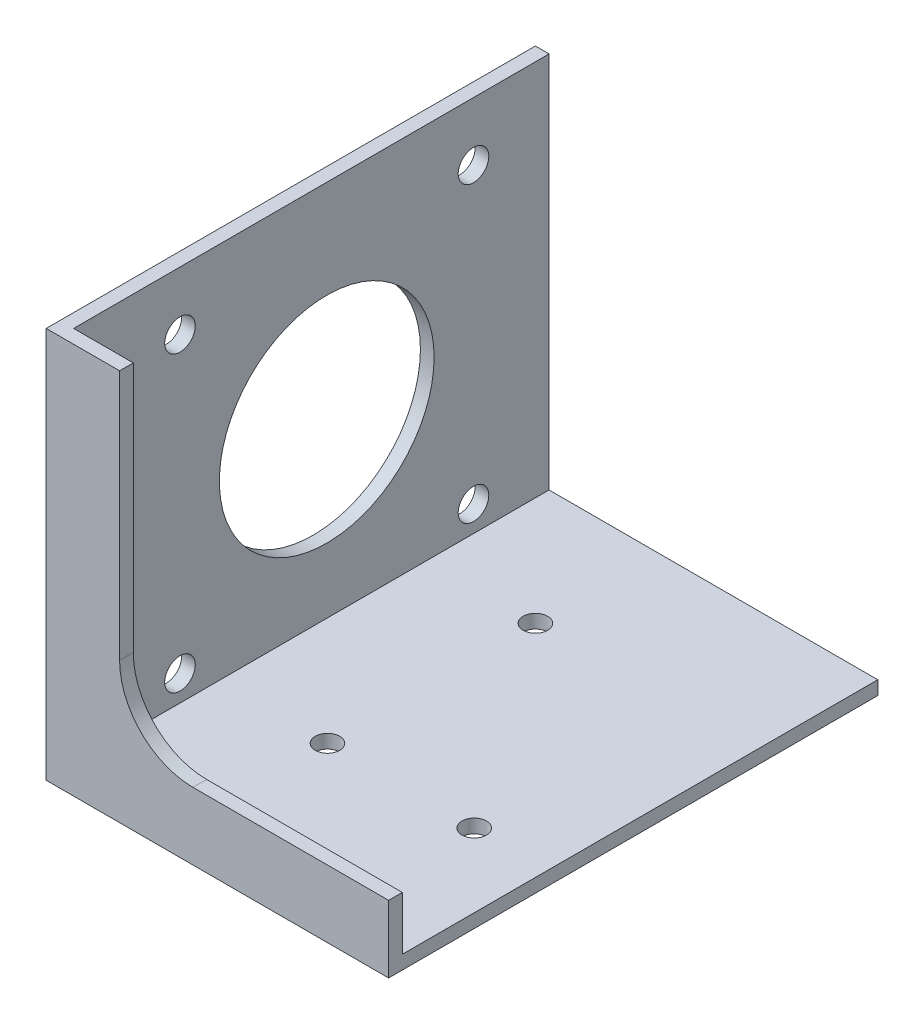
ISO-10303-21;
HEADER;
FILE_DESCRIPTION(('STEP AP214'),'2;1');
FILE_NAME('part.step','',(''),(''),'','','');
FILE_SCHEMA(('AUTOMOTIVE_DESIGN { 1 0 10303 214 1 1 1 1 }'));
ENDSEC;
DATA;
#1=APPLICATION_CONTEXT('core data for automotive mechanical design processes');
#2=APPLICATION_PROTOCOL_DEFINITION('international standard','automotive_design',2000,#1);
#3=PRODUCT_CONTEXT('',#1,'mechanical');
#4=PRODUCT('Part','Part','',(#3));
#5=PRODUCT_RELATED_PRODUCT_CATEGORY('part','',(#4));
#6=PRODUCT_DEFINITION_FORMATION('','',#4);
#7=PRODUCT_DEFINITION_CONTEXT('part definition',#1,'design');
#8=PRODUCT_DEFINITION('design','',#6,#7);
#9=PRODUCT_DEFINITION_SHAPE('','',#8);
#10=(LENGTH_UNIT() NAMED_UNIT(*) SI_UNIT(.MILLI.,.METRE.));
#11=(NAMED_UNIT(*) PLANE_ANGLE_UNIT() SI_UNIT($,.RADIAN.));
#12=(NAMED_UNIT(*) SI_UNIT($,.STERADIAN.) SOLID_ANGLE_UNIT());
#13=UNCERTAINTY_MEASURE_WITH_UNIT(LENGTH_MEASURE(1.E-05),#10,'distance_accuracy_value','');
#14=(GEOMETRIC_REPRESENTATION_CONTEXT(3) GLOBAL_UNCERTAINTY_ASSIGNED_CONTEXT((#13)) GLOBAL_UNIT_ASSIGNED_CONTEXT((#10,
#11,#12)) REPRESENTATION_CONTEXT('',''));
#15=CARTESIAN_POINT('',(0.,0.,0.));
#16=DIRECTION('',(0.,0.,1.));
#17=DIRECTION('',(1.,0.,0.));
#18=AXIS2_PLACEMENT_3D('',#15,#16,#17);
#19=CARTESIAN_POINT('',(-17.78,20.32,-25.4));
#20=DIRECTION('',(1.,0.,0.));
#21=DIRECTION('',(0.,0.,-1.));
#22=AXIS2_PLACEMENT_3D('',#19,#20,#21);
#23=PLANE('',#22);
#24=CARTESIAN_POINT('',(-17.78,-16.2306,12.9286));
#25=DIRECTION('',(1.,0.,0.));
#26=DIRECTION('',(0.,0.,-1.));
#27=AXIS2_PLACEMENT_3D('',#24,#25,#26);
#28=CIRCLE('',#27,1.5875);
#29=CARTESIAN_POINT('',(-17.78,-16.2306,11.3411));
#30=VERTEX_POINT('',#29);
#31=EDGE_CURVE('E205',#30,#30,#28,.T.);
#32=ORIENTED_EDGE('',*,*,#31,.T.);
#33=EDGE_LOOP('',(#32));
#34=FACE_BOUND('',#33,.T.);
#35=CARTESIAN_POINT('',(-17.78,-16.2306,-17.5514));
#36=DIRECTION('',(1.,0.,0.));
#37=DIRECTION('',(0.,0.,-1.));
#38=AXIS2_PLACEMENT_3D('',#35,#36,#37);
#39=CIRCLE('',#38,1.5875);
#40=CARTESIAN_POINT('',(-17.78,-16.2306,-19.1389));
#41=VERTEX_POINT('',#40);
#42=EDGE_CURVE('E209',#41,#41,#39,.T.);
#43=ORIENTED_EDGE('',*,*,#42,.T.);
#44=EDGE_LOOP('',(#43));
#45=FACE_BOUND('',#44,.T.);
#46=CARTESIAN_POINT('',(-17.78,14.2494,-17.5514));
#47=DIRECTION('',(1.,0.,0.));
#48=DIRECTION('',(0.,0.,-1.));
#49=AXIS2_PLACEMENT_3D('',#46,#47,#48);
#50=CIRCLE('',#49,1.5875);
#51=CARTESIAN_POINT('',(-17.78,14.2494,-19.1389));
#52=VERTEX_POINT('',#51);
#53=EDGE_CURVE('E213',#52,#52,#50,.T.);
#54=ORIENTED_EDGE('',*,*,#53,.T.);
#55=EDGE_LOOP('',(#54));
#56=FACE_BOUND('',#55,.T.);
#57=CARTESIAN_POINT('',(-17.78,14.2494,12.9286));
#58=DIRECTION('',(1.,0.,0.));
#59=DIRECTION('',(0.,0.,-1.));
#60=AXIS2_PLACEMENT_3D('',#57,#58,#59);
#61=CIRCLE('',#60,1.5875);
#62=CARTESIAN_POINT('',(-17.78,14.2494,11.3411));
#63=VERTEX_POINT('',#62);
#64=EDGE_CURVE('E217',#63,#63,#61,.T.);
#65=ORIENTED_EDGE('',*,*,#64,.T.);
#66=EDGE_LOOP('',(#65));
#67=FACE_BOUND('',#66,.T.);
#68=CARTESIAN_POINT('',(-17.78,-0.990599999999998,-2.3114));
#69=DIRECTION('',(1.,0.,0.));
#70=DIRECTION('',(0.,0.,-1.));
#71=AXIS2_PLACEMENT_3D('',#68,#69,#70);
#72=CIRCLE('',#71,11.1506);
#73=CARTESIAN_POINT('',(-17.78,-0.990599999999998,-13.462));
#74=VERTEX_POINT('',#73);
#75=EDGE_CURVE('E220',#74,#74,#72,.T.);
#76=ORIENTED_EDGE('',*,*,#75,.T.);
#77=EDGE_LOOP('',(#76));
#78=FACE_BOUND('',#77,.T.);
#79=DIRECTION('',(0.,0.,1.));
#80=VECTOR('',#79,1.);
#81=CARTESIAN_POINT('',(-17.78,-20.32,-25.4));
#82=LINE('',#81,#80);
#83=CARTESIAN_POINT('',(-17.78,-20.32,-25.4));
#84=VERTEX_POINT('',#83);
#85=CARTESIAN_POINT('',(-17.78,-20.32,25.4));
#86=VERTEX_POINT('',#85);
#87=EDGE_CURVE('E160',#84,#86,#82,.T.);
#88=ORIENTED_EDGE('',*,*,#87,.T.);
#89=DIRECTION('',(0.,-1.,0.));
#90=VECTOR('',#89,1.);
#91=CARTESIAN_POINT('',(-17.78,20.32,25.4));
#92=LINE('',#91,#90);
#93=CARTESIAN_POINT('',(-17.78,20.32,25.4));
#94=VERTEX_POINT('',#93);
#95=EDGE_CURVE('E12',#94,#86,#92,.T.);
#96=ORIENTED_EDGE('',*,*,#95,.F.);
#97=DIRECTION('',(0.,0.,1.));
#98=VECTOR('',#97,1.);
#99=CARTESIAN_POINT('',(-17.78,20.32,-25.4));
#100=LINE('',#99,#98);
#101=CARTESIAN_POINT('',(-17.78,20.32,-25.4));
#102=VERTEX_POINT('',#101);
#103=EDGE_CURVE('E147',#102,#94,#100,.T.);
#104=ORIENTED_EDGE('',*,*,#103,.F.);
#105=DIRECTION('',(0.,-1.,0.));
#106=VECTOR('',#105,1.);
#107=CARTESIAN_POINT('',(-17.78,20.32,-25.4));
#108=LINE('',#107,#106);
#109=EDGE_CURVE('E154',#102,#84,#108,.T.);
#110=ORIENTED_EDGE('',*,*,#109,.T.);
#111=EDGE_LOOP('',(#88,#96,#104,#110));
#112=FACE_BOUND('',#111,.T.);
#113=ADVANCED_FACE('F43',(#34,#45,#56,#67,#78,#112),#23,.F.);
#114=CARTESIAN_POINT('',(-17.78,20.32,25.4));
#115=DIRECTION('',(0.,0.,-1.));
#116=DIRECTION('',(-1.,0.,0.));
#117=AXIS2_PLACEMENT_3D('',#114,#115,#116);
#118=PLANE('',#117);
#119=CARTESIAN_POINT('',(-2.54,-5.715,25.4));
#120=DIRECTION('',(0.,0.,1.));
#121=DIRECTION('',(1.,0.,0.));
#122=AXIS2_PLACEMENT_3D('',#119,#120,#121);
#123=CIRCLE('',#122,7.62);
#124=CARTESIAN_POINT('',(-10.16,-5.715,25.4));
#125=VERTEX_POINT('',#124);
#126=CARTESIAN_POINT('',(-2.54,-13.335,25.4));
#127=VERTEX_POINT('',#126);
#128=EDGE_CURVE('E134',#125,#127,#123,.T.);
#129=ORIENTED_EDGE('',*,*,#128,.F.);
#130=DIRECTION('',(0.,1.,0.));
#131=VECTOR('',#130,1.);
#132=CARTESIAN_POINT('',(-10.16,-5.715,25.4));
#133=LINE('',#132,#131);
#134=CARTESIAN_POINT('',(-10.16,20.32,25.4));
#135=VERTEX_POINT('',#134);
#136=EDGE_CURVE('E125',#125,#135,#133,.T.);
#137=ORIENTED_EDGE('',*,*,#136,.T.);
#138=DIRECTION('',(1.,0.,0.));
#139=VECTOR('',#138,1.);
#140=CARTESIAN_POINT('',(-17.78,20.32,25.4));
#141=LINE('',#140,#139);
#142=EDGE_CURVE('E138',#94,#135,#141,.T.);
#143=ORIENTED_EDGE('',*,*,#142,.F.);
#144=ORIENTED_EDGE('',*,*,#95,.T.);
#145=DIRECTION('',(1.,0.,0.));
#146=VECTOR('',#145,1.);
#147=CARTESIAN_POINT('',(-17.78,-20.32,25.4));
#148=LINE('',#147,#146);
#149=CARTESIAN_POINT('',(17.78,-20.32,25.4));
#150=VERTEX_POINT('',#149);
#151=EDGE_CURVE('E164',#86,#150,#148,.T.);
#152=ORIENTED_EDGE('',*,*,#151,.T.);
#153=DIRECTION('',(0.,-1.,0.));
#154=VECTOR('',#153,1.);
#155=CARTESIAN_POINT('',(17.78,20.32,25.4));
#156=LINE('',#155,#154);
#157=CARTESIAN_POINT('',(17.78,-13.335,25.4));
#158=VERTEX_POINT('',#157);
#159=EDGE_CURVE('E51',#158,#150,#156,.T.);
#160=ORIENTED_EDGE('',*,*,#159,.F.);
#161=DIRECTION('',(-1.,0.,0.));
#162=VECTOR('',#161,1.);
#163=CARTESIAN_POINT('',(17.78,-13.335,25.4));
#164=LINE('',#163,#162);
#165=EDGE_CURVE('E142',#158,#127,#164,.T.);
#166=ORIENTED_EDGE('',*,*,#165,.T.);
#167=EDGE_LOOP('',(#129,#137,#143,#144,#152,#160,#166));
#168=FACE_BOUND('',#167,.T.);
#169=ADVANCED_FACE('F137',(#168),#118,.F.);
#170=CARTESIAN_POINT('',(17.78,20.32,-25.4));
#171=DIRECTION('',(-1.,0.,0.));
#172=DIRECTION('',(0.,0.,1.));
#173=AXIS2_PLACEMENT_3D('',#170,#171,#172);
#174=PLANE('',#173);
#175=DIRECTION('',(0.,-1.,0.));
#176=VECTOR('',#175,1.);
#177=CARTESIAN_POINT('',(17.78,20.32,23.9776));
#178=LINE('',#177,#176);
#179=CARTESIAN_POINT('',(17.78,-13.335,23.9776));
#180=VERTEX_POINT('',#179);
#181=CARTESIAN_POINT('',(17.78,-18.8976,23.9776));
#182=VERTEX_POINT('',#181);
#183=EDGE_CURVE('E273',#180,#182,#178,.T.);
#184=ORIENTED_EDGE('',*,*,#183,.F.);
#185=DIRECTION('',(0.,0.,-1.));
#186=VECTOR('',#185,1.);
#187=CARTESIAN_POINT('',(17.78,-13.335,25.4));
#188=LINE('',#187,#186);
#189=EDGE_CURVE('E58',#158,#180,#188,.T.);
#190=ORIENTED_EDGE('',*,*,#189,.F.);
#191=ORIENTED_EDGE('',*,*,#159,.T.);
#192=DIRECTION('',(0.,0.,-1.));
#193=VECTOR('',#192,1.);
#194=CARTESIAN_POINT('',(17.78,-20.32,-25.4));
#195=LINE('',#194,#193);
#196=CARTESIAN_POINT('',(17.78,-20.32,-25.4));
#197=VERTEX_POINT('',#196);
#198=EDGE_CURVE('E169',#150,#197,#195,.T.);
#199=ORIENTED_EDGE('',*,*,#198,.T.);
#200=DIRECTION('',(0.,-1.,0.));
#201=VECTOR('',#200,1.);
#202=CARTESIAN_POINT('',(17.78,20.32,-25.4));
#203=LINE('',#202,#201);
#204=CARTESIAN_POINT('',(17.78,-18.8976,-25.4));
#205=VERTEX_POINT('',#204);
#206=EDGE_CURVE('E178',#205,#197,#203,.T.);
#207=ORIENTED_EDGE('',*,*,#206,.F.);
#208=DIRECTION('',(0.,0.,-1.));
#209=VECTOR('',#208,1.);
#210=CARTESIAN_POINT('',(17.78,-18.8976,23.9776));
#211=LINE('',#210,#209);
#212=EDGE_CURVE('E288',#182,#205,#211,.T.);
#213=ORIENTED_EDGE('',*,*,#212,.F.);
#214=EDGE_LOOP('',(#184,#190,#191,#199,#207,#213));
#215=FACE_BOUND('',#214,.T.);
#216=ADVANCED_FACE('F184',(#215),#174,.F.);
#217=CARTESIAN_POINT('',(-17.78,20.32,-25.4));
#218=DIRECTION('',(0.,0.,1.));
#219=DIRECTION('',(1.,0.,0.));
#220=AXIS2_PLACEMENT_3D('',#217,#218,#219);
#221=PLANE('',#220);
#222=DIRECTION('',(0.,-1.,0.));
#223=VECTOR('',#222,1.);
#224=CARTESIAN_POINT('',(-16.3576,20.32,-25.4));
#225=LINE('',#224,#223);
#226=CARTESIAN_POINT('',(-16.3576,20.32,-25.4));
#227=VERTEX_POINT('',#226);
#228=CARTESIAN_POINT('',(-16.3576,-18.8976,-25.4));
#229=VERTEX_POINT('',#228);
#230=EDGE_CURVE('E66',#227,#229,#225,.T.);
#231=ORIENTED_EDGE('',*,*,#230,.T.);
#232=DIRECTION('',(1.,0.,0.));
#233=VECTOR('',#232,1.);
#234=CARTESIAN_POINT('',(-80.8368595120309,-18.8976,-25.4));
#235=LINE('',#234,#233);
#236=EDGE_CURVE('E281',#229,#205,#235,.T.);
#237=ORIENTED_EDGE('',*,*,#236,.T.);
#238=ORIENTED_EDGE('',*,*,#206,.T.);
#239=DIRECTION('',(-1.,0.,0.));
#240=VECTOR('',#239,1.);
#241=CARTESIAN_POINT('',(-17.78,-20.32,-25.4));
#242=LINE('',#241,#240);
#243=EDGE_CURVE('E156',#197,#84,#242,.T.);
#244=ORIENTED_EDGE('',*,*,#243,.T.);
#245=ORIENTED_EDGE('',*,*,#109,.F.);
#246=DIRECTION('',(-1.,0.,0.));
#247=VECTOR('',#246,1.);
#248=CARTESIAN_POINT('',(-17.78,20.32,-25.4));
#249=LINE('',#248,#247);
#250=EDGE_CURVE('E150',#227,#102,#249,.T.);
#251=ORIENTED_EDGE('',*,*,#250,.F.);
#252=EDGE_LOOP('',(#231,#237,#238,#244,#245,#251));
#253=FACE_BOUND('',#252,.T.);
#254=ADVANCED_FACE('F193',(#253),#221,.F.);
#255=CARTESIAN_POINT('',(0.,20.32,0.));
#256=DIRECTION('',(0.,1.,0.));
#257=DIRECTION('',(0.,0.,1.));
#258=AXIS2_PLACEMENT_3D('',#255,#256,#257);
#259=PLANE('',#258);
#260=DIRECTION('',(0.,0.,-1.));
#261=VECTOR('',#260,1.);
#262=CARTESIAN_POINT('',(-10.16,20.32,25.4));
#263=LINE('',#262,#261);
#264=CARTESIAN_POINT('',(-10.16,20.32,23.9776));
#265=VERTEX_POINT('',#264);
#266=EDGE_CURVE('E122',#135,#265,#263,.T.);
#267=ORIENTED_EDGE('',*,*,#266,.T.);
#268=DIRECTION('',(1.,0.,0.));
#269=VECTOR('',#268,1.);
#270=CARTESIAN_POINT('',(-80.8368595120309,20.32,23.9776));
#271=LINE('',#270,#269);
#272=CARTESIAN_POINT('',(-16.3576,20.32,23.9776));
#273=VERTEX_POINT('',#272);
#274=EDGE_CURVE('E291',#273,#265,#271,.T.);
#275=ORIENTED_EDGE('',*,*,#274,.F.);
#276=DIRECTION('',(0.,0.,-1.));
#277=VECTOR('',#276,1.);
#278=CARTESIAN_POINT('',(-16.3576,20.32,23.9776));
#279=LINE('',#278,#277);
#280=EDGE_CURVE('E165',#273,#227,#279,.T.);
#281=ORIENTED_EDGE('',*,*,#280,.T.);
#282=ORIENTED_EDGE('',*,*,#250,.T.);
#283=ORIENTED_EDGE('',*,*,#103,.T.);
#284=ORIENTED_EDGE('',*,*,#142,.T.);
#285=EDGE_LOOP('',(#267,#275,#281,#282,#283,#284));
#286=FACE_BOUND('',#285,.T.);
#287=ADVANCED_FACE('F145',(#286),#259,.T.);
#288=CARTESIAN_POINT('',(0.,-20.32,0.));
#289=DIRECTION('',(0.,1.,0.));
#290=DIRECTION('',(0.,0.,1.));
#291=AXIS2_PLACEMENT_3D('',#288,#289,#290);
#292=PLANE('',#291);
#293=CARTESIAN_POINT('',(-5.08,-20.32,-12.7));
#294=DIRECTION('',(0.,1.,0.));
#295=DIRECTION('',(0.,0.,1.));
#296=AXIS2_PLACEMENT_3D('',#293,#294,#295);
#297=CIRCLE('',#296,1.27);
#298=CARTESIAN_POINT('',(-5.08,-20.32,-11.43));
#299=VERTEX_POINT('',#298);
#300=EDGE_CURVE('E262',#299,#299,#297,.T.);
#301=ORIENTED_EDGE('',*,*,#300,.T.);
#302=EDGE_LOOP('',(#301));
#303=FACE_BOUND('',#302,.T.);
#304=CARTESIAN_POINT('',(10.16,-20.32,8.89));
#305=DIRECTION('',(0.,1.,0.));
#306=DIRECTION('',(0.,0.,1.));
#307=AXIS2_PLACEMENT_3D('',#304,#305,#306);
#308=CIRCLE('',#307,1.27);
#309=CARTESIAN_POINT('',(10.16,-20.32,10.16));
#310=VERTEX_POINT('',#309);
#311=EDGE_CURVE('E253',#310,#310,#308,.T.);
#312=ORIENTED_EDGE('',*,*,#311,.T.);
#313=EDGE_LOOP('',(#312));
#314=FACE_BOUND('',#313,.T.);
#315=CARTESIAN_POINT('',(-5.08,-20.32,8.89));
#316=DIRECTION('',(0.,1.,0.));
#317=DIRECTION('',(0.,0.,1.));
#318=AXIS2_PLACEMENT_3D('',#315,#316,#317);
#319=CIRCLE('',#318,1.27);
#320=CARTESIAN_POINT('',(-5.08,-20.32,10.16));
#321=VERTEX_POINT('',#320);
#322=EDGE_CURVE('E269',#321,#321,#319,.T.);
#323=ORIENTED_EDGE('',*,*,#322,.T.);
#324=EDGE_LOOP('',(#323));
#325=FACE_BOUND('',#324,.T.);
#326=ORIENTED_EDGE('',*,*,#87,.F.);
#327=ORIENTED_EDGE('',*,*,#243,.F.);
#328=ORIENTED_EDGE('',*,*,#198,.F.);
#329=ORIENTED_EDGE('',*,*,#151,.F.);
#330=EDGE_LOOP('',(#326,#327,#328,#329));
#331=FACE_BOUND('',#330,.T.);
#332=ADVANCED_FACE('F190',(#303,#314,#325,#331),#292,.F.);
#333=CARTESIAN_POINT('',(-80.8368595120309,-18.8976,23.9776));
#334=DIRECTION('',(0.,-1.,0.));
#335=DIRECTION('',(0.,0.,-1.));
#336=AXIS2_PLACEMENT_3D('',#333,#334,#335);
#337=PLANE('',#336);
#338=CARTESIAN_POINT('',(-5.08,-18.8976,-12.7));
#339=DIRECTION('',(0.,1.,0.));
#340=DIRECTION('',(0.,0.,1.));
#341=AXIS2_PLACEMENT_3D('',#338,#339,#340);
#342=CIRCLE('',#341,1.27);
#343=CARTESIAN_POINT('',(-5.08,-18.8976,-11.43));
#344=VERTEX_POINT('',#343);
#345=EDGE_CURVE('E247',#344,#344,#342,.T.);
#346=ORIENTED_EDGE('',*,*,#345,.F.);
#347=EDGE_LOOP('',(#346));
#348=FACE_BOUND('',#347,.T.);
#349=CARTESIAN_POINT('',(10.16,-18.8976,8.89));
#350=DIRECTION('',(0.,1.,0.));
#351=DIRECTION('',(0.,0.,1.));
#352=AXIS2_PLACEMENT_3D('',#349,#350,#351);
#353=CIRCLE('',#352,1.27);
#354=CARTESIAN_POINT('',(10.16,-18.8976,10.16));
#355=VERTEX_POINT('',#354);
#356=EDGE_CURVE('E258',#355,#355,#353,.T.);
#357=ORIENTED_EDGE('',*,*,#356,.F.);
#358=EDGE_LOOP('',(#357));
#359=FACE_BOUND('',#358,.T.);
#360=CARTESIAN_POINT('',(-5.08,-18.8976,8.89));
#361=DIRECTION('',(0.,1.,0.));
#362=DIRECTION('',(0.,0.,1.));
#363=AXIS2_PLACEMENT_3D('',#360,#361,#362);
#364=CIRCLE('',#363,1.27);
#365=CARTESIAN_POINT('',(-5.08,-18.8976,10.16));
#366=VERTEX_POINT('',#365);
#367=EDGE_CURVE('E257',#366,#366,#364,.T.);
#368=ORIENTED_EDGE('',*,*,#367,.F.);
#369=EDGE_LOOP('',(#368));
#370=FACE_BOUND('',#369,.T.);
#371=DIRECTION('',(0.,0.,1.));
#372=VECTOR('',#371,1.);
#373=CARTESIAN_POINT('',(-16.3576,-18.8976,23.9776));
#374=LINE('',#373,#372);
#375=CARTESIAN_POINT('',(-16.3576,-18.8976,23.9776));
#376=VERTEX_POINT('',#375);
#377=EDGE_CURVE('E280',#229,#376,#374,.T.);
#378=ORIENTED_EDGE('',*,*,#377,.T.);
#379=DIRECTION('',(1.,0.,0.));
#380=VECTOR('',#379,1.);
#381=CARTESIAN_POINT('',(-80.8368595120309,-18.8976,23.9776));
#382=LINE('',#381,#380);
#383=EDGE_CURVE('E294',#376,#182,#382,.T.);
#384=ORIENTED_EDGE('',*,*,#383,.T.);
#385=ORIENTED_EDGE('',*,*,#212,.T.);
#386=ORIENTED_EDGE('',*,*,#236,.F.);
#387=EDGE_LOOP('',(#378,#384,#385,#386));
#388=FACE_BOUND('',#387,.T.);
#389=ADVANCED_FACE('F304',(#348,#359,#370,#388),#337,.F.);
#390=CARTESIAN_POINT('',(-80.8368595120309,20.32,23.9776));
#391=DIRECTION('',(0.,0.,1.));
#392=DIRECTION('',(1.,0.,0.));
#393=AXIS2_PLACEMENT_3D('',#390,#391,#392);
#394=PLANE('',#393);
#395=ORIENTED_EDGE('',*,*,#274,.T.);
#396=DIRECTION('',(0.,1.,0.));
#397=VECTOR('',#396,1.);
#398=CARTESIAN_POINT('',(-10.16,-5.715,23.9776));
#399=LINE('',#398,#397);
#400=CARTESIAN_POINT('',(-10.16,-5.715,23.9776));
#401=VERTEX_POINT('',#400);
#402=EDGE_CURVE('E128',#401,#265,#399,.T.);
#403=ORIENTED_EDGE('',*,*,#402,.F.);
#404=CARTESIAN_POINT('',(-2.54,-5.715,23.9776));
#405=DIRECTION('',(0.,0.,1.));
#406=DIRECTION('',(1.,0.,0.));
#407=AXIS2_PLACEMENT_3D('',#404,#405,#406);
#408=CIRCLE('',#407,7.62);
#409=CARTESIAN_POINT('',(-2.54,-13.335,23.9776));
#410=VERTEX_POINT('',#409);
#411=EDGE_CURVE('E143',#401,#410,#408,.T.);
#412=ORIENTED_EDGE('',*,*,#411,.T.);
#413=DIRECTION('',(-1.,0.,0.));
#414=VECTOR('',#413,1.);
#415=CARTESIAN_POINT('',(17.78,-13.335,23.9776));
#416=LINE('',#415,#414);
#417=EDGE_CURVE('E227',#180,#410,#416,.T.);
#418=ORIENTED_EDGE('',*,*,#417,.F.);
#419=ORIENTED_EDGE('',*,*,#183,.T.);
#420=ORIENTED_EDGE('',*,*,#383,.F.);
#421=DIRECTION('',(0.,1.,0.));
#422=VECTOR('',#421,1.);
#423=CARTESIAN_POINT('',(-16.3576,20.32,23.9776));
#424=LINE('',#423,#422);
#425=EDGE_CURVE('E277',#376,#273,#424,.T.);
#426=ORIENTED_EDGE('',*,*,#425,.T.);
#427=EDGE_LOOP('',(#395,#403,#412,#418,#419,#420,#426));
#428=FACE_BOUND('',#427,.T.);
#429=ADVANCED_FACE('F307',(#428),#394,.F.);
#430=CARTESIAN_POINT('',(-16.3576,20.32,-25.4));
#431=DIRECTION('',(1.,0.,0.));
#432=DIRECTION('',(0.,0.,-1.));
#433=AXIS2_PLACEMENT_3D('',#430,#431,#432);
#434=PLANE('',#433);
#435=CARTESIAN_POINT('',(-16.3576,-16.2306,12.9286));
#436=DIRECTION('',(1.,0.,0.));
#437=DIRECTION('',(0.,0.,-1.));
#438=AXIS2_PLACEMENT_3D('',#435,#436,#437);
#439=CIRCLE('',#438,1.5875);
#440=CARTESIAN_POINT('',(-16.3576,-16.2306,11.3411));
#441=VERTEX_POINT('',#440);
#442=EDGE_CURVE('E232',#441,#441,#439,.T.);
#443=ORIENTED_EDGE('',*,*,#442,.F.);
#444=EDGE_LOOP('',(#443));
#445=FACE_BOUND('',#444,.T.);
#446=CARTESIAN_POINT('',(-16.3576,-16.2306,-17.5514));
#447=DIRECTION('',(1.,0.,0.));
#448=DIRECTION('',(0.,0.,-1.));
#449=AXIS2_PLACEMENT_3D('',#446,#447,#448);
#450=CIRCLE('',#449,1.5875);
#451=CARTESIAN_POINT('',(-16.3576,-16.2306,-19.1389));
#452=VERTEX_POINT('',#451);
#453=EDGE_CURVE('E491',#452,#452,#450,.T.);
#454=ORIENTED_EDGE('',*,*,#453,.F.);
#455=EDGE_LOOP('',(#454));
#456=FACE_BOUND('',#455,.T.);
#457=CARTESIAN_POINT('',(-16.3576,14.2494,-17.5514));
#458=DIRECTION('',(1.,0.,0.));
#459=DIRECTION('',(0.,0.,-1.));
#460=AXIS2_PLACEMENT_3D('',#457,#458,#459);
#461=CIRCLE('',#460,1.5875);
#462=CARTESIAN_POINT('',(-16.3576,14.2494,-19.1389));
#463=VERTEX_POINT('',#462);
#464=EDGE_CURVE('E498',#463,#463,#461,.T.);
#465=ORIENTED_EDGE('',*,*,#464,.F.);
#466=EDGE_LOOP('',(#465));
#467=FACE_BOUND('',#466,.T.);
#468=CARTESIAN_POINT('',(-16.3576,14.2494,12.9286));
#469=DIRECTION('',(1.,0.,0.));
#470=DIRECTION('',(0.,0.,-1.));
#471=AXIS2_PLACEMENT_3D('',#468,#469,#470);
#472=CIRCLE('',#471,1.5875);
#473=CARTESIAN_POINT('',(-16.3576,14.2494,11.3411));
#474=VERTEX_POINT('',#473);
#475=EDGE_CURVE('E504',#474,#474,#472,.T.);
#476=ORIENTED_EDGE('',*,*,#475,.F.);
#477=EDGE_LOOP('',(#476));
#478=FACE_BOUND('',#477,.T.);
#479=CARTESIAN_POINT('',(-16.3576,-0.990599999999998,-2.3114));
#480=DIRECTION('',(1.,0.,0.));
#481=DIRECTION('',(0.,0.,-1.));
#482=AXIS2_PLACEMENT_3D('',#479,#480,#481);
#483=CIRCLE('',#482,11.1506);
#484=CARTESIAN_POINT('',(-16.3576,-0.990599999999998,-13.462));
#485=VERTEX_POINT('',#484);
#486=EDGE_CURVE('E223',#485,#485,#483,.T.);
#487=ORIENTED_EDGE('',*,*,#486,.F.);
#488=EDGE_LOOP('',(#487));
#489=FACE_BOUND('',#488,.T.);
#490=ORIENTED_EDGE('',*,*,#230,.F.);
#491=ORIENTED_EDGE('',*,*,#280,.F.);
#492=ORIENTED_EDGE('',*,*,#425,.F.);
#493=ORIENTED_EDGE('',*,*,#377,.F.);
#494=EDGE_LOOP('',(#490,#491,#492,#493));
#495=FACE_BOUND('',#494,.T.);
#496=ADVANCED_FACE('F336',(#445,#456,#467,#478,#489,#495),#434,.T.);
#497=CARTESIAN_POINT('',(-5.08,-20.32,8.89));
#498=DIRECTION('',(0.,1.,0.));
#499=DIRECTION('',(0.,0.,1.));
#500=AXIS2_PLACEMENT_3D('',#497,#498,#499);
#501=CYLINDRICAL_SURFACE('',#500,1.27);
#502=ORIENTED_EDGE('',*,*,#322,.F.);
#503=EDGE_LOOP('',(#502));
#504=FACE_BOUND('',#503,.T.);
#505=ORIENTED_EDGE('',*,*,#367,.T.);
#506=EDGE_LOOP('',(#505));
#507=FACE_BOUND('',#506,.T.);
#508=ADVANCED_FACE('F329',(#504,#507),#501,.F.);
#509=CARTESIAN_POINT('',(10.16,-20.32,8.89));
#510=DIRECTION('',(0.,1.,0.));
#511=DIRECTION('',(0.,0.,1.));
#512=AXIS2_PLACEMENT_3D('',#509,#510,#511);
#513=CYLINDRICAL_SURFACE('',#512,1.27);
#514=ORIENTED_EDGE('',*,*,#311,.F.);
#515=EDGE_LOOP('',(#514));
#516=FACE_BOUND('',#515,.T.);
#517=ORIENTED_EDGE('',*,*,#356,.T.);
#518=EDGE_LOOP('',(#517));
#519=FACE_BOUND('',#518,.T.);
#520=ADVANCED_FACE('F326',(#516,#519),#513,.F.);
#521=CARTESIAN_POINT('',(-5.08,-20.32,-12.7));
#522=DIRECTION('',(0.,1.,0.));
#523=DIRECTION('',(0.,0.,1.));
#524=AXIS2_PLACEMENT_3D('',#521,#522,#523);
#525=CYLINDRICAL_SURFACE('',#524,1.27);
#526=ORIENTED_EDGE('',*,*,#300,.F.);
#527=EDGE_LOOP('',(#526));
#528=FACE_BOUND('',#527,.T.);
#529=ORIENTED_EDGE('',*,*,#345,.T.);
#530=EDGE_LOOP('',(#529));
#531=FACE_BOUND('',#530,.T.);
#532=ADVANCED_FACE('F321',(#528,#531),#525,.F.);
#533=CARTESIAN_POINT('',(-10.16,-5.715,25.4));
#534=DIRECTION('',(-1.,0.,0.));
#535=DIRECTION('',(0.,-1.,0.));
#536=AXIS2_PLACEMENT_3D('',#533,#534,#535);
#537=PLANE('',#536);
#538=ORIENTED_EDGE('',*,*,#402,.T.);
#539=ORIENTED_EDGE('',*,*,#266,.F.);
#540=ORIENTED_EDGE('',*,*,#136,.F.);
#541=DIRECTION('',(0.,0.,-1.));
#542=VECTOR('',#541,1.);
#543=CARTESIAN_POINT('',(-10.16,-5.715,25.4));
#544=LINE('',#543,#542);
#545=EDGE_CURVE('E244',#125,#401,#544,.T.);
#546=ORIENTED_EDGE('',*,*,#545,.T.);
#547=EDGE_LOOP('',(#538,#539,#540,#546));
#548=FACE_BOUND('',#547,.T.);
#549=ADVANCED_FACE('F124',(#548),#537,.F.);
#550=CARTESIAN_POINT('',(-2.54,-5.715,25.4));
#551=DIRECTION('',(0.,0.,-1.));
#552=DIRECTION('',(-1.,0.,0.));
#553=AXIS2_PLACEMENT_3D('',#550,#551,#552);
#554=CYLINDRICAL_SURFACE('',#553,7.62);
#555=ORIENTED_EDGE('',*,*,#411,.F.);
#556=ORIENTED_EDGE('',*,*,#545,.F.);
#557=ORIENTED_EDGE('',*,*,#128,.T.);
#558=DIRECTION('',(0.,0.,-1.));
#559=VECTOR('',#558,1.);
#560=CARTESIAN_POINT('',(-2.54,-13.335,25.4));
#561=LINE('',#560,#559);
#562=EDGE_CURVE('E248',#127,#410,#561,.T.);
#563=ORIENTED_EDGE('',*,*,#562,.T.);
#564=EDGE_LOOP('',(#555,#556,#557,#563));
#565=FACE_BOUND('',#564,.T.);
#566=ADVANCED_FACE('F312',(#565),#554,.F.);
#567=CARTESIAN_POINT('',(17.78,-13.335,25.4));
#568=DIRECTION('',(0.,-1.,0.));
#569=DIRECTION('',(0.,0.,-1.));
#570=AXIS2_PLACEMENT_3D('',#567,#568,#569);
#571=PLANE('',#570);
#572=ORIENTED_EDGE('',*,*,#417,.T.);
#573=ORIENTED_EDGE('',*,*,#562,.F.);
#574=ORIENTED_EDGE('',*,*,#165,.F.);
#575=ORIENTED_EDGE('',*,*,#189,.T.);
#576=EDGE_LOOP('',(#572,#573,#574,#575));
#577=FACE_BOUND('',#576,.T.);
#578=ADVANCED_FACE('F310',(#577),#571,.F.);
#579=CARTESIAN_POINT('',(-17.78,-0.990599999999998,-2.3114));
#580=DIRECTION('',(1.,0.,0.));
#581=DIRECTION('',(0.,0.,-1.));
#582=AXIS2_PLACEMENT_3D('',#579,#580,#581);
#583=CYLINDRICAL_SURFACE('',#582,11.1506);
#584=ORIENTED_EDGE('',*,*,#75,.F.);
#585=EDGE_LOOP('',(#584));
#586=FACE_BOUND('',#585,.T.);
#587=ORIENTED_EDGE('',*,*,#486,.T.);
#588=EDGE_LOOP('',(#587));
#589=FACE_BOUND('',#588,.T.);
#590=ADVANCED_FACE('F319',(#586,#589),#583,.F.);
#591=CARTESIAN_POINT('',(-17.78,14.2494,12.9286));
#592=DIRECTION('',(1.,0.,0.));
#593=DIRECTION('',(0.,0.,-1.));
#594=AXIS2_PLACEMENT_3D('',#591,#592,#593);
#595=CYLINDRICAL_SURFACE('',#594,1.5875);
#596=ORIENTED_EDGE('',*,*,#64,.F.);
#597=EDGE_LOOP('',(#596));
#598=FACE_BOUND('',#597,.T.);
#599=ORIENTED_EDGE('',*,*,#475,.T.);
#600=EDGE_LOOP('',(#599));
#601=FACE_BOUND('',#600,.T.);
#602=ADVANCED_FACE('F445',(#598,#601),#595,.F.);
#603=CARTESIAN_POINT('',(-17.78,14.2494,-17.5514));
#604=DIRECTION('',(1.,0.,0.));
#605=DIRECTION('',(0.,0.,-1.));
#606=AXIS2_PLACEMENT_3D('',#603,#604,#605);
#607=CYLINDRICAL_SURFACE('',#606,1.5875);
#608=ORIENTED_EDGE('',*,*,#53,.F.);
#609=EDGE_LOOP('',(#608));
#610=FACE_BOUND('',#609,.T.);
#611=ORIENTED_EDGE('',*,*,#464,.T.);
#612=EDGE_LOOP('',(#611));
#613=FACE_BOUND('',#612,.T.);
#614=ADVANCED_FACE('F450',(#610,#613),#607,.F.);
#615=CARTESIAN_POINT('',(-17.78,-16.2306,-17.5514));
#616=DIRECTION('',(1.,0.,0.));
#617=DIRECTION('',(0.,0.,-1.));
#618=AXIS2_PLACEMENT_3D('',#615,#616,#617);
#619=CYLINDRICAL_SURFACE('',#618,1.5875);
#620=ORIENTED_EDGE('',*,*,#42,.F.);
#621=EDGE_LOOP('',(#620));
#622=FACE_BOUND('',#621,.T.);
#623=ORIENTED_EDGE('',*,*,#453,.T.);
#624=EDGE_LOOP('',(#623));
#625=FACE_BOUND('',#624,.T.);
#626=ADVANCED_FACE('F458',(#622,#625),#619,.F.);
#627=CARTESIAN_POINT('',(-17.78,-16.2306,12.9286));
#628=DIRECTION('',(1.,0.,0.));
#629=DIRECTION('',(0.,0.,-1.));
#630=AXIS2_PLACEMENT_3D('',#627,#628,#629);
#631=CYLINDRICAL_SURFACE('',#630,1.5875);
#632=ORIENTED_EDGE('',*,*,#31,.F.);
#633=EDGE_LOOP('',(#632));
#634=FACE_BOUND('',#633,.T.);
#635=ORIENTED_EDGE('',*,*,#442,.T.);
#636=EDGE_LOOP('',(#635));
#637=FACE_BOUND('',#636,.T.);
#638=ADVANCED_FACE('F466',(#634,#637),#631,.F.);
#639=CLOSED_SHELL('',(#113,#169,#216,#254,#287,#332,#389,#429,#496,#508,#520,#532,#549,#566,
#578,#590,#602,#614,#626,#638));
#640=MANIFOLD_SOLID_BREP('B2',#639);
#641=ADVANCED_BREP_SHAPE_REPRESENTATION('',(#18,#640),#14);
#642=SHAPE_DEFINITION_REPRESENTATION(#9,#641);
ENDSEC;
END-ISO-10303-21;
